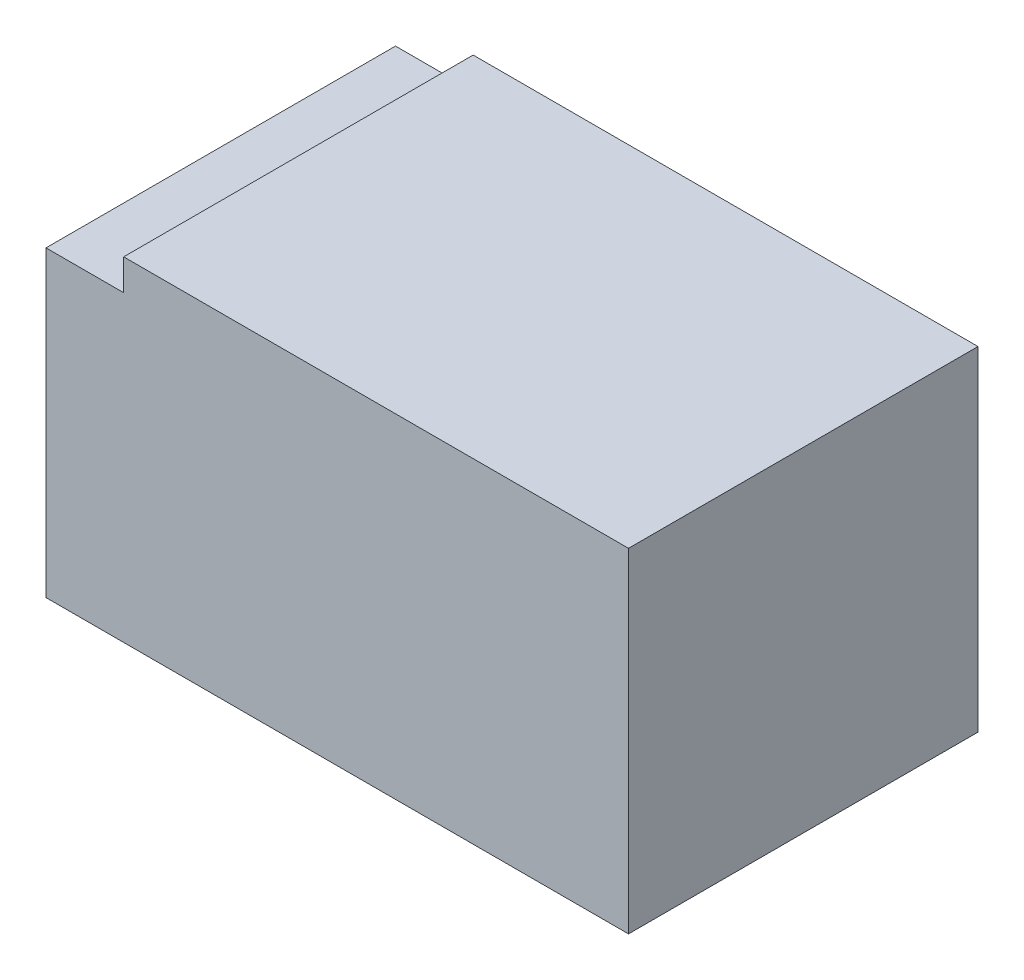
ISO-10303-21;
HEADER;
FILE_DESCRIPTION(('STEP AP214'),'2;1');
FILE_NAME('part.step','',(''),(''),'','','');
FILE_SCHEMA(('AUTOMOTIVE_DESIGN { 1 0 10303 214 1 1 1 1 }'));
ENDSEC;
DATA;
#1=APPLICATION_CONTEXT('core data for automotive mechanical design processes');
#2=APPLICATION_PROTOCOL_DEFINITION('international standard','automotive_design',2000,#1);
#3=PRODUCT_CONTEXT('',#1,'mechanical');
#4=PRODUCT('Part','Part','',(#3));
#5=PRODUCT_RELATED_PRODUCT_CATEGORY('part','',(#4));
#6=PRODUCT_DEFINITION_FORMATION('','',#4);
#7=PRODUCT_DEFINITION_CONTEXT('part definition',#1,'design');
#8=PRODUCT_DEFINITION('design','',#6,#7);
#9=PRODUCT_DEFINITION_SHAPE('','',#8);
#10=(LENGTH_UNIT() NAMED_UNIT(*) SI_UNIT(.MILLI.,.METRE.));
#11=(NAMED_UNIT(*) PLANE_ANGLE_UNIT() SI_UNIT($,.RADIAN.));
#12=(NAMED_UNIT(*) SI_UNIT($,.STERADIAN.) SOLID_ANGLE_UNIT());
#13=UNCERTAINTY_MEASURE_WITH_UNIT(LENGTH_MEASURE(1.E-05),#10,'distance_accuracy_value','');
#14=(GEOMETRIC_REPRESENTATION_CONTEXT(3) GLOBAL_UNCERTAINTY_ASSIGNED_CONTEXT((#13)) GLOBAL_UNIT_ASSIGNED_CONTEXT((#10,
#11,#12)) REPRESENTATION_CONTEXT('',''));
#15=CARTESIAN_POINT('',(0.,0.,0.));
#16=DIRECTION('',(0.,0.,1.));
#17=DIRECTION('',(1.,0.,0.));
#18=AXIS2_PLACEMENT_3D('',#15,#16,#17);
#19=CARTESIAN_POINT('',(0.,78.,90.));
#20=DIRECTION('',(1.,0.,0.));
#21=DIRECTION('',(0.,0.,-1.));
#22=AXIS2_PLACEMENT_3D('',#19,#20,#21);
#23=PLANE('',#22);
#24=DIRECTION('',(0.,-1.,0.));
#25=VECTOR('',#24,1.);
#26=CARTESIAN_POINT('',(0.,78.,0.));
#27=LINE('',#26,#25);
#28=CARTESIAN_POINT('',(0.,78.,0.));
#29=VERTEX_POINT('',#28);
#30=CARTESIAN_POINT('',(0.,0.,0.));
#31=VERTEX_POINT('',#30);
#32=EDGE_CURVE('E119',#29,#31,#27,.T.);
#33=ORIENTED_EDGE('',*,*,#32,.T.);
#34=DIRECTION('',(0.,0.,-1.));
#35=VECTOR('',#34,1.);
#36=CARTESIAN_POINT('',(0.,0.,90.));
#37=LINE('',#36,#35);
#38=CARTESIAN_POINT('',(0.,0.,90.));
#39=VERTEX_POINT('',#38);
#40=EDGE_CURVE('E11',#39,#31,#37,.T.);
#41=ORIENTED_EDGE('',*,*,#40,.F.);
#42=DIRECTION('',(0.,-1.,0.));
#43=VECTOR('',#42,1.);
#44=CARTESIAN_POINT('',(0.,78.,90.));
#45=LINE('',#44,#43);
#46=CARTESIAN_POINT('',(0.,78.,90.));
#47=VERTEX_POINT('',#46);
#48=EDGE_CURVE('E129',#47,#39,#45,.T.);
#49=ORIENTED_EDGE('',*,*,#48,.F.);
#50=DIRECTION('',(0.,0.,-1.));
#51=VECTOR('',#50,1.);
#52=CARTESIAN_POINT('',(0.,78.,90.));
#53=LINE('',#52,#51);
#54=EDGE_CURVE('E115',#47,#29,#53,.T.);
#55=ORIENTED_EDGE('',*,*,#54,.T.);
#56=EDGE_LOOP('',(#33,#41,#49,#55));
#57=FACE_BOUND('',#56,.T.);
#58=ADVANCED_FACE('F35',(#57),#23,.F.);
#59=CARTESIAN_POINT('',(0.,0.,90.));
#60=DIRECTION('',(0.,1.,0.));
#61=DIRECTION('',(0.,0.,1.));
#62=AXIS2_PLACEMENT_3D('',#59,#60,#61);
#63=PLANE('',#62);
#64=DIRECTION('',(1.,0.,0.));
#65=VECTOR('',#64,1.);
#66=CARTESIAN_POINT('',(0.,0.,0.));
#67=LINE('',#66,#65);
#68=CARTESIAN_POINT('',(150.,0.,0.));
#69=VERTEX_POINT('',#68);
#70=EDGE_CURVE('E122',#31,#69,#67,.T.);
#71=ORIENTED_EDGE('',*,*,#70,.T.);
#72=DIRECTION('',(0.,0.,-1.));
#73=VECTOR('',#72,1.);
#74=CARTESIAN_POINT('',(150.,0.,90.));
#75=LINE('',#74,#73);
#76=CARTESIAN_POINT('',(150.,0.,90.));
#77=VERTEX_POINT('',#76);
#78=EDGE_CURVE('E43',#77,#69,#75,.T.);
#79=ORIENTED_EDGE('',*,*,#78,.F.);
#80=DIRECTION('',(1.,0.,0.));
#81=VECTOR('',#80,1.);
#82=CARTESIAN_POINT('',(0.,0.,90.));
#83=LINE('',#82,#81);
#84=EDGE_CURVE('E88',#39,#77,#83,.T.);
#85=ORIENTED_EDGE('',*,*,#84,.F.);
#86=ORIENTED_EDGE('',*,*,#40,.T.);
#87=EDGE_LOOP('',(#71,#79,#85,#86));
#88=FACE_BOUND('',#87,.T.);
#89=ADVANCED_FACE('F153',(#88),#63,.F.);
#90=CARTESIAN_POINT('',(150.,0.,90.));
#91=DIRECTION('',(-1.,0.,0.));
#92=DIRECTION('',(0.,0.,1.));
#93=AXIS2_PLACEMENT_3D('',#90,#91,#92);
#94=PLANE('',#93);
#95=DIRECTION('',(0.,1.,0.));
#96=VECTOR('',#95,1.);
#97=CARTESIAN_POINT('',(150.,0.,0.));
#98=LINE('',#97,#96);
#99=CARTESIAN_POINT('',(150.,86.,0.));
#100=VERTEX_POINT('',#99);
#101=EDGE_CURVE('E124',#69,#100,#98,.T.);
#102=ORIENTED_EDGE('',*,*,#101,.T.);
#103=DIRECTION('',(0.,0.,-1.));
#104=VECTOR('',#103,1.);
#105=CARTESIAN_POINT('',(150.,86.,90.));
#106=LINE('',#105,#104);
#107=CARTESIAN_POINT('',(150.,86.,90.));
#108=VERTEX_POINT('',#107);
#109=EDGE_CURVE('E110',#108,#100,#106,.T.);
#110=ORIENTED_EDGE('',*,*,#109,.F.);
#111=DIRECTION('',(0.,1.,0.));
#112=VECTOR('',#111,1.);
#113=CARTESIAN_POINT('',(150.,0.,90.));
#114=LINE('',#113,#112);
#115=EDGE_CURVE('E101',#77,#108,#114,.T.);
#116=ORIENTED_EDGE('',*,*,#115,.F.);
#117=ORIENTED_EDGE('',*,*,#78,.T.);
#118=EDGE_LOOP('',(#102,#110,#116,#117));
#119=FACE_BOUND('',#118,.T.);
#120=ADVANCED_FACE('F135',(#119),#94,.F.);
#121=CARTESIAN_POINT('',(150.,86.,90.));
#122=DIRECTION('',(0.,-1.,0.));
#123=DIRECTION('',(1.,0.,0.));
#124=AXIS2_PLACEMENT_3D('',#121,#122,#123);
#125=PLANE('',#124);
#126=DIRECTION('',(-1.,0.,0.));
#127=VECTOR('',#126,1.);
#128=CARTESIAN_POINT('',(150.,86.,0.));
#129=LINE('',#128,#127);
#130=CARTESIAN_POINT('',(20.,86.,0.));
#131=VERTEX_POINT('',#130);
#132=EDGE_CURVE('E109',#100,#131,#129,.T.);
#133=ORIENTED_EDGE('',*,*,#132,.T.);
#134=DIRECTION('',(0.,0.,-1.));
#135=VECTOR('',#134,1.);
#136=CARTESIAN_POINT('',(20.,86.,90.));
#137=LINE('',#136,#135);
#138=CARTESIAN_POINT('',(20.,86.,90.));
#139=VERTEX_POINT('',#138);
#140=EDGE_CURVE('E106',#139,#131,#137,.T.);
#141=ORIENTED_EDGE('',*,*,#140,.F.);
#142=DIRECTION('',(-1.,0.,0.));
#143=VECTOR('',#142,1.);
#144=CARTESIAN_POINT('',(150.,86.,90.));
#145=LINE('',#144,#143);
#146=EDGE_CURVE('E95',#108,#139,#145,.T.);
#147=ORIENTED_EDGE('',*,*,#146,.F.);
#148=ORIENTED_EDGE('',*,*,#109,.T.);
#149=EDGE_LOOP('',(#133,#141,#147,#148));
#150=FACE_BOUND('',#149,.T.);
#151=ADVANCED_FACE('F107',(#150),#125,.F.);
#152=CARTESIAN_POINT('',(20.,86.,90.));
#153=DIRECTION('',(1.,0.,0.));
#154=DIRECTION('',(0.,0.,-1.));
#155=AXIS2_PLACEMENT_3D('',#152,#153,#154);
#156=PLANE('',#155);
#157=DIRECTION('',(0.,-1.,0.));
#158=VECTOR('',#157,1.);
#159=CARTESIAN_POINT('',(20.,86.,0.));
#160=LINE('',#159,#158);
#161=CARTESIAN_POINT('',(20.,78.,0.));
#162=VERTEX_POINT('',#161);
#163=EDGE_CURVE('E74',#131,#162,#160,.T.);
#164=ORIENTED_EDGE('',*,*,#163,.T.);
#165=DIRECTION('',(0.,0.,-1.));
#166=VECTOR('',#165,1.);
#167=CARTESIAN_POINT('',(20.,78.,90.));
#168=LINE('',#167,#166);
#169=CARTESIAN_POINT('',(20.,78.,90.));
#170=VERTEX_POINT('',#169);
#171=EDGE_CURVE('E111',#170,#162,#168,.T.);
#172=ORIENTED_EDGE('',*,*,#171,.F.);
#173=DIRECTION('',(0.,-1.,0.));
#174=VECTOR('',#173,1.);
#175=CARTESIAN_POINT('',(20.,86.,90.));
#176=LINE('',#175,#174);
#177=EDGE_CURVE('E99',#139,#170,#176,.T.);
#178=ORIENTED_EDGE('',*,*,#177,.F.);
#179=ORIENTED_EDGE('',*,*,#140,.T.);
#180=EDGE_LOOP('',(#164,#172,#178,#179));
#181=FACE_BOUND('',#180,.T.);
#182=ADVANCED_FACE('F113',(#181),#156,.F.);
#183=CARTESIAN_POINT('',(20.,78.,90.));
#184=DIRECTION('',(0.,-1.,0.));
#185=DIRECTION('',(0.,0.,-1.));
#186=AXIS2_PLACEMENT_3D('',#183,#184,#185);
#187=PLANE('',#186);
#188=DIRECTION('',(-1.,0.,0.));
#189=VECTOR('',#188,1.);
#190=CARTESIAN_POINT('',(20.,78.,0.));
#191=LINE('',#190,#189);
#192=EDGE_CURVE('E80',#162,#29,#191,.T.);
#193=ORIENTED_EDGE('',*,*,#192,.T.);
#194=ORIENTED_EDGE('',*,*,#54,.F.);
#195=DIRECTION('',(-1.,0.,0.));
#196=VECTOR('',#195,1.);
#197=CARTESIAN_POINT('',(20.,78.,90.));
#198=LINE('',#197,#196);
#199=EDGE_CURVE('E51',#170,#47,#198,.T.);
#200=ORIENTED_EDGE('',*,*,#199,.F.);
#201=ORIENTED_EDGE('',*,*,#171,.T.);
#202=EDGE_LOOP('',(#193,#194,#200,#201));
#203=FACE_BOUND('',#202,.T.);
#204=ADVANCED_FACE('F142',(#203),#187,.F.);
#205=CARTESIAN_POINT('',(0.,0.,90.));
#206=DIRECTION('',(0.,0.,1.));
#207=DIRECTION('',(1.,0.,0.));
#208=AXIS2_PLACEMENT_3D('',#205,#206,#207);
#209=PLANE('',#208);
#210=ORIENTED_EDGE('',*,*,#48,.T.);
#211=ORIENTED_EDGE('',*,*,#84,.T.);
#212=ORIENTED_EDGE('',*,*,#115,.T.);
#213=ORIENTED_EDGE('',*,*,#146,.T.);
#214=ORIENTED_EDGE('',*,*,#177,.T.);
#215=ORIENTED_EDGE('',*,*,#199,.T.);
#216=EDGE_LOOP('',(#210,#211,#212,#213,#214,#215));
#217=FACE_BOUND('',#216,.T.);
#218=ADVANCED_FACE('F97',(#217),#209,.T.);
#219=CARTESIAN_POINT('',(0.,0.,0.));
#220=DIRECTION('',(0.,0.,1.));
#221=DIRECTION('',(1.,0.,0.));
#222=AXIS2_PLACEMENT_3D('',#219,#220,#221);
#223=PLANE('',#222);
#224=ORIENTED_EDGE('',*,*,#32,.F.);
#225=ORIENTED_EDGE('',*,*,#192,.F.);
#226=ORIENTED_EDGE('',*,*,#163,.F.);
#227=ORIENTED_EDGE('',*,*,#132,.F.);
#228=ORIENTED_EDGE('',*,*,#101,.F.);
#229=ORIENTED_EDGE('',*,*,#70,.F.);
#230=EDGE_LOOP('',(#224,#225,#226,#227,#228,#229));
#231=FACE_BOUND('',#230,.T.);
#232=ADVANCED_FACE('F138',(#231),#223,.F.);
#233=CLOSED_SHELL('',(#58,#89,#120,#151,#182,#204,#218,#232));
#234=MANIFOLD_SOLID_BREP('B2',#233);
#235=ADVANCED_BREP_SHAPE_REPRESENTATION('',(#18,#234),#14);
#236=SHAPE_DEFINITION_REPRESENTATION(#9,#235);
ENDSEC;
END-ISO-10303-21;
